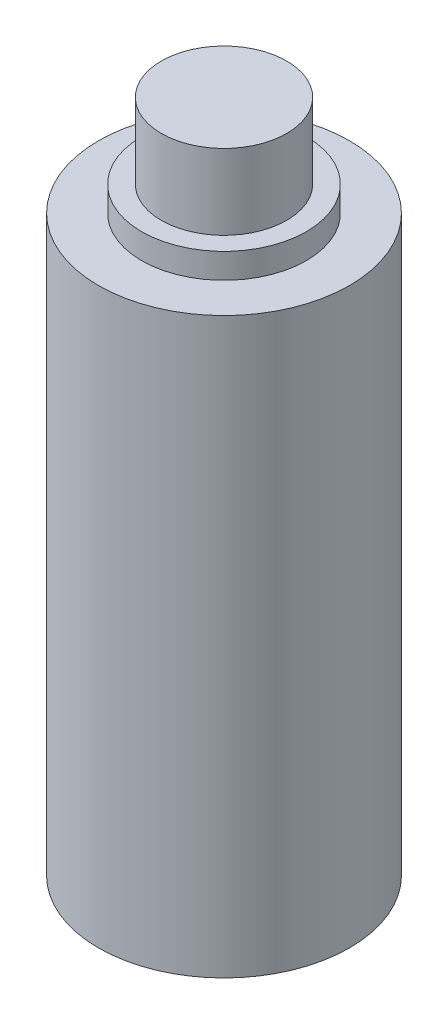
ISO-10303-21;
HEADER;
FILE_DESCRIPTION(('STEP AP214'),'2;1');
FILE_NAME('part.step','',(''),(''),'','','');
FILE_SCHEMA(('AUTOMOTIVE_DESIGN { 1 0 10303 214 1 1 1 1 }'));
ENDSEC;
DATA;
#1=APPLICATION_CONTEXT('core data for automotive mechanical design processes');
#2=APPLICATION_PROTOCOL_DEFINITION('international standard','automotive_design',2000,#1);
#3=PRODUCT_CONTEXT('',#1,'mechanical');
#4=PRODUCT('Part','Part','',(#3));
#5=PRODUCT_RELATED_PRODUCT_CATEGORY('part','',(#4));
#6=PRODUCT_DEFINITION_FORMATION('','',#4);
#7=PRODUCT_DEFINITION_CONTEXT('part definition',#1,'design');
#8=PRODUCT_DEFINITION('design','',#6,#7);
#9=PRODUCT_DEFINITION_SHAPE('','',#8);
#10=(LENGTH_UNIT() NAMED_UNIT(*) SI_UNIT(.MILLI.,.METRE.));
#11=(NAMED_UNIT(*) PLANE_ANGLE_UNIT() SI_UNIT($,.RADIAN.));
#12=(NAMED_UNIT(*) SI_UNIT($,.STERADIAN.) SOLID_ANGLE_UNIT());
#13=UNCERTAINTY_MEASURE_WITH_UNIT(LENGTH_MEASURE(1.E-05),#10,'distance_accuracy_value','');
#14=(GEOMETRIC_REPRESENTATION_CONTEXT(3) GLOBAL_UNCERTAINTY_ASSIGNED_CONTEXT((#13)) GLOBAL_UNIT_ASSIGNED_CONTEXT((#10,
#11,#12)) REPRESENTATION_CONTEXT('',''));
#15=CARTESIAN_POINT('',(0.,0.,0.));
#16=DIRECTION('',(0.,0.,1.));
#17=DIRECTION('',(1.,0.,0.));
#18=AXIS2_PLACEMENT_3D('',#15,#16,#17);
#19=CARTESIAN_POINT('',(0.,18.288,0.));
#20=DIRECTION('',(0.,-1.,0.));
#21=DIRECTION('',(0.,0.,-1.));
#22=AXIS2_PLACEMENT_3D('',#19,#20,#21);
#23=CYLINDRICAL_SURFACE('',#22,4.);
#24=CARTESIAN_POINT('',(0.,18.288,0.));
#25=DIRECTION('',(0.,1.,0.));
#26=DIRECTION('',(0.,0.,1.));
#27=AXIS2_PLACEMENT_3D('',#24,#25,#26);
#28=CIRCLE('',#27,4.);
#29=CARTESIAN_POINT('',(0.,18.288,4.));
#30=VERTEX_POINT('',#29);
#31=EDGE_CURVE('E55',#30,#30,#28,.T.);
#32=ORIENTED_EDGE('',*,*,#31,.F.);
#33=EDGE_LOOP('',(#32));
#34=FACE_BOUND('',#33,.T.);
#35=CARTESIAN_POINT('',(0.,0.,0.));
#36=DIRECTION('',(0.,1.,0.));
#37=DIRECTION('',(0.,0.,1.));
#38=AXIS2_PLACEMENT_3D('',#35,#36,#37);
#39=CIRCLE('',#38,4.);
#40=CARTESIAN_POINT('',(0.,0.,4.));
#41=VERTEX_POINT('',#40);
#42=EDGE_CURVE('E44',#41,#41,#39,.T.);
#43=ORIENTED_EDGE('',*,*,#42,.T.);
#44=EDGE_LOOP('',(#43));
#45=FACE_BOUND('',#44,.T.);
#46=ADVANCED_FACE('F41',(#34,#45),#23,.T.);
#47=CARTESIAN_POINT('',(0.,18.288,0.));
#48=DIRECTION('',(0.,1.,0.));
#49=DIRECTION('',(0.,0.,1.));
#50=AXIS2_PLACEMENT_3D('',#47,#48,#49);
#51=PLANE('',#50);
#52=CARTESIAN_POINT('',(0.,18.288,0.));
#53=DIRECTION('',(0.,1.,0.));
#54=DIRECTION('',(0.,0.,1.));
#55=AXIS2_PLACEMENT_3D('',#52,#53,#54);
#56=CIRCLE('',#55,2.625);
#57=CARTESIAN_POINT('',(0.,18.288,2.625));
#58=VERTEX_POINT('',#57);
#59=EDGE_CURVE('E49',#58,#58,#56,.T.);
#60=ORIENTED_EDGE('',*,*,#59,.F.);
#61=EDGE_LOOP('',(#60));
#62=FACE_BOUND('',#61,.T.);
#63=ORIENTED_EDGE('',*,*,#31,.T.);
#64=EDGE_LOOP('',(#63));
#65=FACE_BOUND('',#64,.T.);
#66=ADVANCED_FACE('F75',(#62,#65),#51,.T.);
#67=CARTESIAN_POINT('',(0.,0.,0.));
#68=DIRECTION('',(0.,1.,0.));
#69=DIRECTION('',(0.,0.,1.));
#70=AXIS2_PLACEMENT_3D('',#67,#68,#69);
#71=PLANE('',#70);
#72=ORIENTED_EDGE('',*,*,#42,.F.);
#73=EDGE_LOOP('',(#72));
#74=FACE_BOUND('',#73,.T.);
#75=ADVANCED_FACE('F72',(#74),#71,.F.);
#76=CARTESIAN_POINT('',(0.,19.088,0.));
#77=DIRECTION('',(0.,-1.,0.));
#78=DIRECTION('',(0.,0.,-1.));
#79=AXIS2_PLACEMENT_3D('',#76,#77,#78);
#80=CYLINDRICAL_SURFACE('',#79,2.625);
#81=CARTESIAN_POINT('',(0.,19.088,0.));
#82=DIRECTION('',(0.,1.,0.));
#83=DIRECTION('',(0.,0.,1.));
#84=AXIS2_PLACEMENT_3D('',#81,#82,#83);
#85=CIRCLE('',#84,2.625);
#86=CARTESIAN_POINT('',(0.,19.088,2.625));
#87=VERTEX_POINT('',#86);
#88=EDGE_CURVE('E60',#87,#87,#85,.T.);
#89=ORIENTED_EDGE('',*,*,#88,.F.);
#90=EDGE_LOOP('',(#89));
#91=FACE_BOUND('',#90,.T.);
#92=ORIENTED_EDGE('',*,*,#59,.T.);
#93=EDGE_LOOP('',(#92));
#94=FACE_BOUND('',#93,.T.);
#95=ADVANCED_FACE('F74',(#91,#94),#80,.T.);
#96=CARTESIAN_POINT('',(0.,19.088,0.));
#97=DIRECTION('',(0.,1.,0.));
#98=DIRECTION('',(0.,0.,1.));
#99=AXIS2_PLACEMENT_3D('',#96,#97,#98);
#100=PLANE('',#99);
#101=CARTESIAN_POINT('',(0.,19.088,0.));
#102=DIRECTION('',(0.,1.,0.));
#103=DIRECTION('',(0.,0.,1.));
#104=AXIS2_PLACEMENT_3D('',#101,#102,#103);
#105=CIRCLE('',#104,2.);
#106=CARTESIAN_POINT('',(0.,19.088,2.));
#107=VERTEX_POINT('',#106);
#108=EDGE_CURVE('E10',#107,#107,#105,.T.);
#109=ORIENTED_EDGE('',*,*,#108,.F.);
#110=EDGE_LOOP('',(#109));
#111=FACE_BOUND('',#110,.T.);
#112=ORIENTED_EDGE('',*,*,#88,.T.);
#113=EDGE_LOOP('',(#112));
#114=FACE_BOUND('',#113,.T.);
#115=ADVANCED_FACE('F81',(#111,#114),#100,.T.);
#116=CARTESIAN_POINT('',(0.,21.488,0.));
#117=DIRECTION('',(0.,-1.,0.));
#118=DIRECTION('',(0.,0.,-1.));
#119=AXIS2_PLACEMENT_3D('',#116,#117,#118);
#120=CYLINDRICAL_SURFACE('',#119,2.);
#121=CARTESIAN_POINT('',(0.,21.488,0.));
#122=DIRECTION('',(0.,1.,0.));
#123=DIRECTION('',(0.,0.,1.));
#124=AXIS2_PLACEMENT_3D('',#121,#122,#123);
#125=CIRCLE('',#124,2.);
#126=CARTESIAN_POINT('',(0.,21.488,2.));
#127=VERTEX_POINT('',#126);
#128=EDGE_CURVE('E59',#127,#127,#125,.T.);
#129=ORIENTED_EDGE('',*,*,#128,.F.);
#130=EDGE_LOOP('',(#129));
#131=FACE_BOUND('',#130,.T.);
#132=ORIENTED_EDGE('',*,*,#108,.T.);
#133=EDGE_LOOP('',(#132));
#134=FACE_BOUND('',#133,.T.);
#135=ADVANCED_FACE('F115',(#131,#134),#120,.T.);
#136=CARTESIAN_POINT('',(0.,21.488,0.));
#137=DIRECTION('',(0.,1.,0.));
#138=DIRECTION('',(0.,0.,1.));
#139=AXIS2_PLACEMENT_3D('',#136,#137,#138);
#140=PLANE('',#139);
#141=ORIENTED_EDGE('',*,*,#128,.T.);
#142=EDGE_LOOP('',(#141));
#143=FACE_BOUND('',#142,.T.);
#144=ADVANCED_FACE('F125',(#143),#140,.T.);
#145=CLOSED_SHELL('',(#46,#66,#75,#95,#115,#135,#144));
#146=MANIFOLD_SOLID_BREP('B2',#145);
#147=ADVANCED_BREP_SHAPE_REPRESENTATION('',(#18,#146),#14);
#148=SHAPE_DEFINITION_REPRESENTATION(#9,#147);
ENDSEC;
END-ISO-10303-21;
